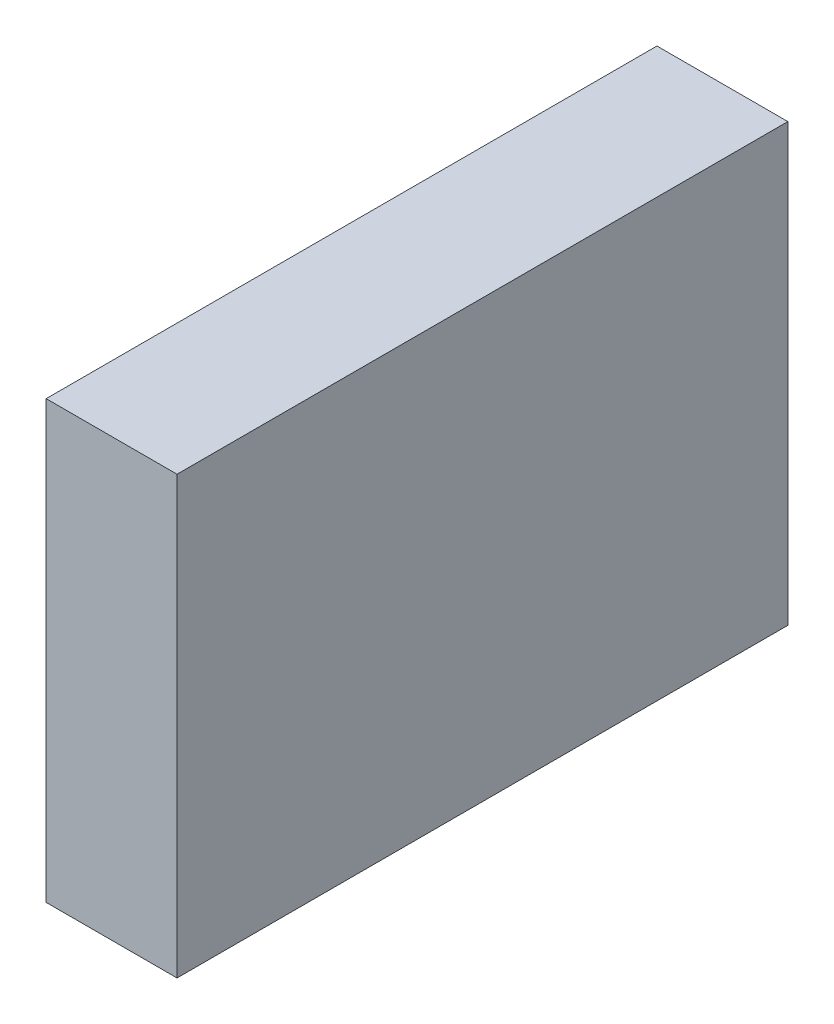
ISO-10303-21;
HEADER;
FILE_DESCRIPTION(('STEP AP214'),'2;1');
FILE_NAME('part.step','',(''),(''),'','','');
FILE_SCHEMA(('AUTOMOTIVE_DESIGN { 1 0 10303 214 1 1 1 1 }'));
ENDSEC;
DATA;
#1=APPLICATION_CONTEXT('core data for automotive mechanical design processes');
#2=APPLICATION_PROTOCOL_DEFINITION('international standard','automotive_design',2000,#1);
#3=PRODUCT_CONTEXT('',#1,'mechanical');
#4=PRODUCT('Part','Part','',(#3));
#5=PRODUCT_RELATED_PRODUCT_CATEGORY('part','',(#4));
#6=PRODUCT_DEFINITION_FORMATION('','',#4);
#7=PRODUCT_DEFINITION_CONTEXT('part definition',#1,'design');
#8=PRODUCT_DEFINITION('design','',#6,#7);
#9=PRODUCT_DEFINITION_SHAPE('','',#8);
#10=(LENGTH_UNIT() NAMED_UNIT(*) SI_UNIT(.MILLI.,.METRE.));
#11=(NAMED_UNIT(*) PLANE_ANGLE_UNIT() SI_UNIT($,.RADIAN.));
#12=(NAMED_UNIT(*) SI_UNIT($,.STERADIAN.) SOLID_ANGLE_UNIT());
#13=UNCERTAINTY_MEASURE_WITH_UNIT(LENGTH_MEASURE(1.E-05),#10,'distance_accuracy_value','');
#14=(GEOMETRIC_REPRESENTATION_CONTEXT(3) GLOBAL_UNCERTAINTY_ASSIGNED_CONTEXT((#13)) GLOBAL_UNIT_ASSIGNED_CONTEXT((#10,
#11,#12)) REPRESENTATION_CONTEXT('',''));
#15=CARTESIAN_POINT('',(0.,0.,0.));
#16=DIRECTION('',(0.,0.,1.));
#17=DIRECTION('',(1.,0.,0.));
#18=AXIS2_PLACEMENT_3D('',#15,#16,#17);
#19=CARTESIAN_POINT('',(-3.,-1.82000017746824,-3.72112168010555));
#20=DIRECTION('',(1.,0.,0.));
#21=DIRECTION('',(0.,1.,8.74227765734759E-08));
#22=AXIS2_PLACEMENT_3D('',#19,#20,#21);
#23=PLANE('',#22);
#24=DIRECTION('',(0.,-8.74227765576152E-08,0.999999999999996));
#25=VECTOR('',#24,1.);
#26=CARTESIAN_POINT('',(-3.,-0.750000183585831,-3.65112158656318));
#27=LINE('',#26,#25);
#28=CARTESIAN_POINT('',(-3.,-0.750000183585831,-3.65112158656218));
#29=VERTEX_POINT('',#28);
#30=CARTESIAN_POINT('',(-3.,-0.750000305978718,-2.25112158656318));
#31=VERTEX_POINT('',#30);
#32=EDGE_CURVE('E11',#29,#31,#27,.T.);
#33=ORIENTED_EDGE('',*,*,#32,.T.);
#34=DIRECTION('',(0.,-0.999999999999996,-8.74227765733007E-08));
#35=VECTOR('',#34,1.);
#36=CARTESIAN_POINT('',(-3.,-0.750000305977718,-2.25112158656318));
#37=LINE('',#36,#35);
#38=CARTESIAN_POINT('',(-3.,-1.75000030597972,-2.25112167398695));
#39=VERTEX_POINT('',#38);
#40=EDGE_CURVE('E69',#31,#39,#37,.T.);
#41=ORIENTED_EDGE('',*,*,#40,.T.);
#42=DIRECTION('',(0.,8.74227764783136E-08,-0.999999999999996));
#43=VECTOR('',#42,1.);
#44=CARTESIAN_POINT('',(-3.,-1.75000030597972,-2.25112167398595));
#45=LINE('',#44,#43);
#46=CARTESIAN_POINT('',(-3.,-1.75000018358683,-3.65112167398595));
#47=VERTEX_POINT('',#46);
#48=EDGE_CURVE('E55',#39,#47,#45,.T.);
#49=ORIENTED_EDGE('',*,*,#48,.T.);
#50=DIRECTION('',(0.,0.999999999999996,8.74227765733007E-08));
#51=VECTOR('',#50,1.);
#52=CARTESIAN_POINT('',(-3.,-1.75000018358783,-3.65112167398595));
#53=LINE('',#52,#51);
#54=EDGE_CURVE('E53',#47,#29,#53,.T.);
#55=ORIENTED_EDGE('',*,*,#54,.T.);
#56=EDGE_LOOP('',(#33,#41,#49,#55));
#57=FACE_BOUND('',#56,.T.);
#58=ADVANCED_FACE('F17',(#57),#23,.T.);
#59=CARTESIAN_POINT('',(-3.3,-1.82000017746824,-3.72112168010555));
#60=DIRECTION('',(1.,0.,0.));
#61=DIRECTION('',(0.,1.,8.74227765734759E-08));
#62=AXIS2_PLACEMENT_3D('',#59,#60,#61);
#63=PLANE('',#62);
#64=DIRECTION('',(0.,0.999999999999996,8.74227765733007E-08));
#65=VECTOR('',#64,1.);
#66=CARTESIAN_POINT('',(-3.3,-1.75000018358783,-3.65112167398595));
#67=LINE('',#66,#65);
#68=CARTESIAN_POINT('',(-3.3,-1.75000018358683,-3.65112167398595));
#69=VERTEX_POINT('',#68);
#70=CARTESIAN_POINT('',(-3.3,-0.750000183585831,-3.65112158656218));
#71=VERTEX_POINT('',#70);
#72=EDGE_CURVE('E24',#69,#71,#67,.T.);
#73=ORIENTED_EDGE('',*,*,#72,.F.);
#74=DIRECTION('',(0.,8.74227766369168E-08,-0.999999999999996));
#75=VECTOR('',#74,1.);
#76=CARTESIAN_POINT('',(-3.3,-1.75000030597972,-2.25112167398595));
#77=LINE('',#76,#75);
#78=CARTESIAN_POINT('',(-3.3,-1.75000030597972,-2.25112167398695));
#79=VERTEX_POINT('',#78);
#80=EDGE_CURVE('E70',#79,#69,#77,.T.);
#81=ORIENTED_EDGE('',*,*,#80,.F.);
#82=DIRECTION('',(0.,-0.999999999999996,-8.74227765733007E-08));
#83=VECTOR('',#82,1.);
#84=CARTESIAN_POINT('',(-3.3,-0.750000305977718,-2.25112158656318));
#85=LINE('',#84,#83);
#86=CARTESIAN_POINT('',(-3.3,-0.750000305978718,-2.25112158656318));
#87=VERTEX_POINT('',#86);
#88=EDGE_CURVE('E59',#87,#79,#85,.T.);
#89=ORIENTED_EDGE('',*,*,#88,.F.);
#90=DIRECTION('',(0.,-8.74227765576152E-08,0.999999999999996));
#91=VECTOR('',#90,1.);
#92=CARTESIAN_POINT('',(-3.3,-0.750000183585831,-3.65112158656318));
#93=LINE('',#92,#91);
#94=EDGE_CURVE('E78',#71,#87,#93,.T.);
#95=ORIENTED_EDGE('',*,*,#94,.F.);
#96=EDGE_LOOP('',(#73,#81,#89,#95));
#97=FACE_BOUND('',#96,.T.);
#98=ADVANCED_FACE('F89',(#97),#63,.F.);
#99=CARTESIAN_POINT('',(-3.,-0.750000183585831,-3.65112158656318));
#100=DIRECTION('',(0.,-1.,-8.74227765734759E-08));
#101=DIRECTION('',(0.,-8.74227765734759E-08,1.));
#102=AXIS2_PLACEMENT_3D('',#99,#100,#101);
#103=PLANE('',#102);
#104=DIRECTION('',(-1.,0.,0.));
#105=VECTOR('',#104,1.);
#106=CARTESIAN_POINT('',(-3.,-0.750000183585831,-3.65112158656318));
#107=LINE('',#106,#105);
#108=EDGE_CURVE('E65',#29,#71,#107,.T.);
#109=ORIENTED_EDGE('',*,*,#108,.T.);
#110=ORIENTED_EDGE('',*,*,#94,.T.);
#111=DIRECTION('',(-1.,0.,0.));
#112=VECTOR('',#111,1.);
#113=CARTESIAN_POINT('',(-3.,-0.750000305977718,-2.25112158656318));
#114=LINE('',#113,#112);
#115=EDGE_CURVE('E66',#31,#87,#114,.T.);
#116=ORIENTED_EDGE('',*,*,#115,.F.);
#117=ORIENTED_EDGE('',*,*,#32,.F.);
#118=EDGE_LOOP('',(#109,#110,#116,#117));
#119=FACE_BOUND('',#118,.T.);
#120=ADVANCED_FACE('F63',(#119),#103,.F.);
#121=CARTESIAN_POINT('',(-3.,-0.750000305977718,-2.25112158656318));
#122=DIRECTION('',(0.,8.74227765734759E-08,-1.));
#123=DIRECTION('',(0.,-1.,-8.74227765734759E-08));
#124=AXIS2_PLACEMENT_3D('',#121,#122,#123);
#125=PLANE('',#124);
#126=ORIENTED_EDGE('',*,*,#115,.T.);
#127=ORIENTED_EDGE('',*,*,#88,.T.);
#128=DIRECTION('',(-1.,0.,0.));
#129=VECTOR('',#128,1.);
#130=CARTESIAN_POINT('',(-3.,-1.75000030597972,-2.25112167398595));
#131=LINE('',#130,#129);
#132=EDGE_CURVE('E60',#39,#79,#131,.T.);
#133=ORIENTED_EDGE('',*,*,#132,.F.);
#134=ORIENTED_EDGE('',*,*,#40,.F.);
#135=EDGE_LOOP('',(#126,#127,#133,#134));
#136=FACE_BOUND('',#135,.T.);
#137=ADVANCED_FACE('F91',(#136),#125,.F.);
#138=CARTESIAN_POINT('',(-3.,-1.75000030597972,-2.25112167398595));
#139=DIRECTION('',(0.,1.,8.74227765734759E-08));
#140=DIRECTION('',(0.,8.74227765734759E-08,-1.));
#141=AXIS2_PLACEMENT_3D('',#138,#139,#140);
#142=PLANE('',#141);
#143=ORIENTED_EDGE('',*,*,#132,.T.);
#144=ORIENTED_EDGE('',*,*,#80,.T.);
#145=DIRECTION('',(-1.,0.,0.));
#146=VECTOR('',#145,1.);
#147=CARTESIAN_POINT('',(-3.,-1.75000018358783,-3.65112167398595));
#148=LINE('',#147,#146);
#149=EDGE_CURVE('E84',#47,#69,#148,.T.);
#150=ORIENTED_EDGE('',*,*,#149,.F.);
#151=ORIENTED_EDGE('',*,*,#48,.F.);
#152=EDGE_LOOP('',(#143,#144,#150,#151));
#153=FACE_BOUND('',#152,.T.);
#154=ADVANCED_FACE('F86',(#153),#142,.F.);
#155=CARTESIAN_POINT('',(-3.,-1.75000018358783,-3.65112167398595));
#156=DIRECTION('',(0.,-8.74227765734759E-08,1.));
#157=DIRECTION('',(0.,1.,8.74227765734759E-08));
#158=AXIS2_PLACEMENT_3D('',#155,#156,#157);
#159=PLANE('',#158);
#160=ORIENTED_EDGE('',*,*,#149,.T.);
#161=ORIENTED_EDGE('',*,*,#72,.T.);
#162=ORIENTED_EDGE('',*,*,#108,.F.);
#163=ORIENTED_EDGE('',*,*,#54,.F.);
#164=EDGE_LOOP('',(#160,#161,#162,#163));
#165=FACE_BOUND('',#164,.T.);
#166=ADVANCED_FACE('F68',(#165),#159,.F.);
#167=CLOSED_SHELL('',(#58,#98,#120,#137,#154,#166));
#168=MANIFOLD_SOLID_BREP('B1',#167);
#169=ADVANCED_BREP_SHAPE_REPRESENTATION('',(#18,#168),#14);
#170=SHAPE_DEFINITION_REPRESENTATION(#9,#169);
ENDSEC;
END-ISO-10303-21;
